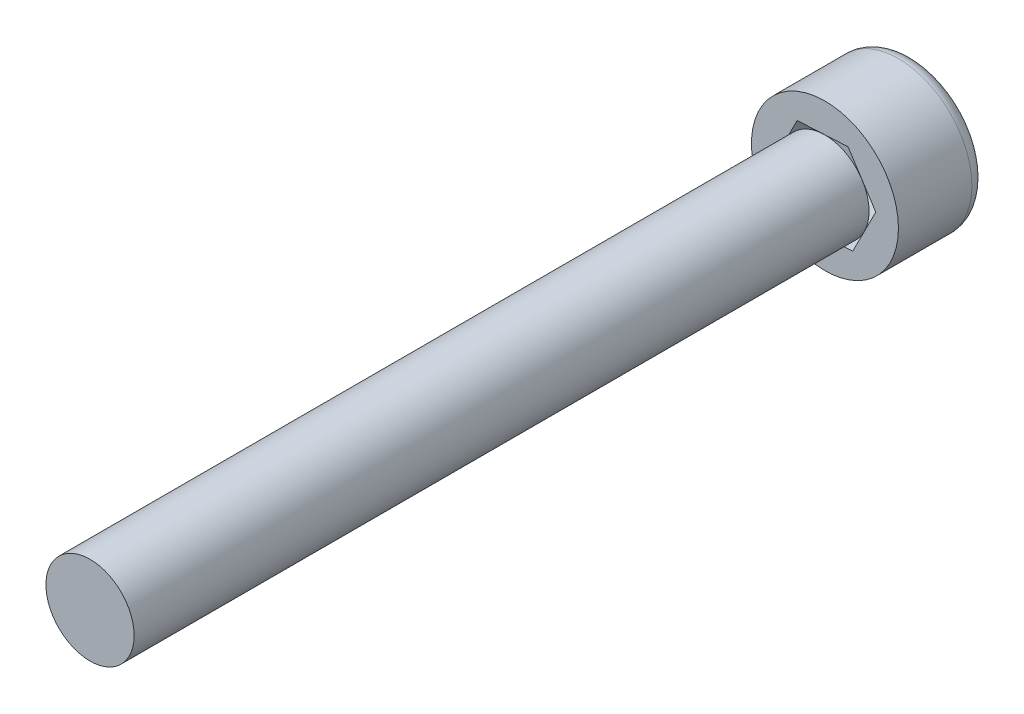
ISO-10303-21;
HEADER;
FILE_DESCRIPTION(('STEP AP214'),'2;1');
FILE_NAME('part.step','',(''),(''),'','','');
FILE_SCHEMA(('AUTOMOTIVE_DESIGN { 1 0 10303 214 1 1 1 1 }'));
ENDSEC;
DATA;
#1=APPLICATION_CONTEXT('core data for automotive mechanical design processes');
#2=APPLICATION_PROTOCOL_DEFINITION('international standard','automotive_design',2000,#1);
#3=PRODUCT_CONTEXT('',#1,'mechanical');
#4=PRODUCT('Part','Part','',(#3));
#5=PRODUCT_RELATED_PRODUCT_CATEGORY('part','',(#4));
#6=PRODUCT_DEFINITION_FORMATION('','',#4);
#7=PRODUCT_DEFINITION_CONTEXT('part definition',#1,'design');
#8=PRODUCT_DEFINITION('design','',#6,#7);
#9=PRODUCT_DEFINITION_SHAPE('','',#8);
#10=(LENGTH_UNIT() NAMED_UNIT(*) SI_UNIT(.MILLI.,.METRE.));
#11=(NAMED_UNIT(*) PLANE_ANGLE_UNIT() SI_UNIT($,.RADIAN.));
#12=(NAMED_UNIT(*) SI_UNIT($,.STERADIAN.) SOLID_ANGLE_UNIT());
#13=UNCERTAINTY_MEASURE_WITH_UNIT(LENGTH_MEASURE(1.E-05),#10,'distance_accuracy_value','');
#14=(GEOMETRIC_REPRESENTATION_CONTEXT(3) GLOBAL_UNCERTAINTY_ASSIGNED_CONTEXT((#13)) GLOBAL_UNIT_ASSIGNED_CONTEXT((#10,
#11,#12)) REPRESENTATION_CONTEXT('',''));
#15=CARTESIAN_POINT('',(0.,0.,0.));
#16=DIRECTION('',(0.,0.,1.));
#17=DIRECTION('',(1.,0.,0.));
#18=AXIS2_PLACEMENT_3D('',#15,#16,#17);
#19=CARTESIAN_POINT('',(0.,0.,3.));
#20=DIRECTION('',(0.,0.,-1.));
#21=DIRECTION('',(-1.,0.,0.));
#22=AXIS2_PLACEMENT_3D('',#19,#20,#21);
#23=CYLINDRICAL_SURFACE('',#22,2.5);
#24=CARTESIAN_POINT('',(0.,0.,0.5));
#25=DIRECTION('',(0.,0.,1.));
#26=DIRECTION('',(1.,0.,0.));
#27=AXIS2_PLACEMENT_3D('',#24,#25,#26);
#28=CIRCLE('',#27,2.5);
#29=CARTESIAN_POINT('',(2.5,0.,0.5));
#30=VERTEX_POINT('',#29);
#31=EDGE_CURVE('E49',#30,#30,#28,.T.);
#32=ORIENTED_EDGE('',*,*,#31,.T.);
#33=EDGE_LOOP('',(#32));
#34=FACE_BOUND('',#33,.T.);
#35=CARTESIAN_POINT('',(0.,0.,3.));
#36=DIRECTION('',(0.,0.,1.));
#37=DIRECTION('',(1.,0.,0.));
#38=AXIS2_PLACEMENT_3D('',#35,#36,#37);
#39=CIRCLE('',#38,2.5);
#40=CARTESIAN_POINT('',(2.5,0.,3.));
#41=VERTEX_POINT('',#40);
#42=EDGE_CURVE('E164',#41,#41,#39,.T.);
#43=ORIENTED_EDGE('',*,*,#42,.F.);
#44=EDGE_LOOP('',(#43));
#45=FACE_BOUND('',#44,.T.);
#46=ADVANCED_FACE('F40',(#34,#45),#23,.T.);
#47=CARTESIAN_POINT('',(0.,0.,3.));
#48=DIRECTION('',(0.,0.,1.));
#49=DIRECTION('',(1.,0.,0.));
#50=AXIS2_PLACEMENT_3D('',#47,#48,#49);
#51=PLANE('',#50);
#52=DIRECTION('',(-0.998565318577122,-0.0535472178079434,0.));
#53=VECTOR('',#52,1.);
#54=CARTESIAN_POINT('',(0.945103759937804,-1.45147472694203,3.));
#55=LINE('',#54,#53);
#56=CARTESIAN_POINT('',(0.945103759937804,-1.45147472694203,3.));
#57=VERTEX_POINT('',#56);
#58=CARTESIAN_POINT('',(-0.784462106513973,-1.54422122878934,3.));
#59=VERTEX_POINT('',#58);
#60=EDGE_CURVE('E93',#57,#59,#55,.T.);
#61=ORIENTED_EDGE('',*,*,#60,.T.);
#62=DIRECTION('',(-0.545655910212218,0.838009324321917,0.));
#63=VECTOR('',#62,1.);
#64=CARTESIAN_POINT('',(-0.784462106513973,-1.54422122878934,3.));
#65=LINE('',#64,#63);
#66=CARTESIAN_POINT('',(-1.72956586645178,-0.0927465018473138,3.));
#67=VERTEX_POINT('',#66);
#68=EDGE_CURVE('E56',#59,#67,#65,.T.);
#69=ORIENTED_EDGE('',*,*,#68,.T.);
#70=DIRECTION('',(0.452909408364904,0.89155654212986,0.));
#71=VECTOR('',#70,1.);
#72=CARTESIAN_POINT('',(-1.72956586645178,-0.0927465018473138,3.));
#73=LINE('',#72,#71);
#74=CARTESIAN_POINT('',(-0.945103759937803,1.45147472694203,3.));
#75=VERTEX_POINT('',#74);
#76=EDGE_CURVE('E103',#67,#75,#73,.T.);
#77=ORIENTED_EDGE('',*,*,#76,.T.);
#78=DIRECTION('',(0.998565318577122,0.0535472178079431,0.));
#79=VECTOR('',#78,1.);
#80=CARTESIAN_POINT('',(-0.945103759937803,1.45147472694203,3.));
#81=LINE('',#80,#79);
#82=CARTESIAN_POINT('',(0.784462106513974,1.54422122878934,3.));
#83=VERTEX_POINT('',#82);
#84=EDGE_CURVE('E175',#75,#83,#81,.T.);
#85=ORIENTED_EDGE('',*,*,#84,.T.);
#86=DIRECTION('',(0.545655910212218,-0.838009324321917,0.));
#87=VECTOR('',#86,1.);
#88=CARTESIAN_POINT('',(0.784462106513974,1.54422122878934,3.));
#89=LINE('',#88,#87);
#90=CARTESIAN_POINT('',(1.72956586645178,0.0927465018473145,3.));
#91=VERTEX_POINT('',#90);
#92=EDGE_CURVE('E173',#83,#91,#89,.T.);
#93=ORIENTED_EDGE('',*,*,#92,.T.);
#94=DIRECTION('',(-0.452909408364904,-0.89155654212986,0.));
#95=VECTOR('',#94,1.);
#96=CARTESIAN_POINT('',(1.72956586645178,0.0927465018473145,3.));
#97=LINE('',#96,#95);
#98=EDGE_CURVE('E108',#91,#57,#97,.T.);
#99=ORIENTED_EDGE('',*,*,#98,.T.);
#100=EDGE_LOOP('',(#61,#69,#77,#85,#93,#99));
#101=FACE_BOUND('',#100,.T.);
#102=ORIENTED_EDGE('',*,*,#42,.T.);
#103=EDGE_LOOP('',(#102));
#104=FACE_BOUND('',#103,.T.);
#105=ADVANCED_FACE('F105',(#101,#104),#51,.T.);
#106=CARTESIAN_POINT('',(0.,0.,0.));
#107=DIRECTION('',(0.,0.,1.));
#108=DIRECTION('',(1.,0.,0.));
#109=AXIS2_PLACEMENT_3D('',#106,#107,#108);
#110=PLANE('',#109);
#111=CARTESIAN_POINT('',(0.,0.,0.));
#112=DIRECTION('',(0.,0.,1.));
#113=DIRECTION('',(1.,0.,0.));
#114=AXIS2_PLACEMENT_3D('',#111,#112,#113);
#115=CIRCLE('',#114,2.);
#116=CARTESIAN_POINT('',(2.,0.,0.));
#117=VERTEX_POINT('',#116);
#118=EDGE_CURVE('E12',#117,#117,#115,.F.);
#119=ORIENTED_EDGE('',*,*,#118,.T.);
#120=EDGE_LOOP('',(#119));
#121=FACE_BOUND('',#120,.T.);
#122=DIRECTION('',(-0.545655910212218,0.838009324321917,0.));
#123=VECTOR('',#122,1.);
#124=CARTESIAN_POINT('',(-0.784462106513973,-1.54422122878934,0.));
#125=LINE('',#124,#123);
#126=CARTESIAN_POINT('',(-0.784462106513973,-1.54422122878934,0.));
#127=VERTEX_POINT('',#126);
#128=CARTESIAN_POINT('',(-1.72956586645178,-0.0927465018473138,0.));
#129=VERTEX_POINT('',#128);
#130=EDGE_CURVE('E98',#127,#129,#125,.T.);
#131=ORIENTED_EDGE('',*,*,#130,.F.);
#132=DIRECTION('',(-0.998565318577122,-0.0535472178079434,0.));
#133=VECTOR('',#132,1.);
#134=CARTESIAN_POINT('',(0.945103759937804,-1.45147472694203,0.));
#135=LINE('',#134,#133);
#136=CARTESIAN_POINT('',(0.945103759937804,-1.45147472694203,0.));
#137=VERTEX_POINT('',#136);
#138=EDGE_CURVE('E89',#137,#127,#135,.T.);
#139=ORIENTED_EDGE('',*,*,#138,.F.);
#140=DIRECTION('',(-0.452909408364904,-0.89155654212986,0.));
#141=VECTOR('',#140,1.);
#142=CARTESIAN_POINT('',(1.72956586645178,0.0927465018473145,0.));
#143=LINE('',#142,#141);
#144=CARTESIAN_POINT('',(1.72956586645178,0.0927465018473145,0.));
#145=VERTEX_POINT('',#144);
#146=EDGE_CURVE('E155',#145,#137,#143,.T.);
#147=ORIENTED_EDGE('',*,*,#146,.F.);
#148=DIRECTION('',(0.545655910212218,-0.838009324321917,0.));
#149=VECTOR('',#148,1.);
#150=CARTESIAN_POINT('',(0.784462106513974,1.54422122878934,0.));
#151=LINE('',#150,#149);
#152=CARTESIAN_POINT('',(0.784462106513974,1.54422122878934,0.));
#153=VERTEX_POINT('',#152);
#154=EDGE_CURVE('E188',#153,#145,#151,.T.);
#155=ORIENTED_EDGE('',*,*,#154,.F.);
#156=DIRECTION('',(0.998565318577122,0.0535472178079431,0.));
#157=VECTOR('',#156,1.);
#158=CARTESIAN_POINT('',(-0.945103759937803,1.45147472694203,0.));
#159=LINE('',#158,#157);
#160=CARTESIAN_POINT('',(-0.945103759937803,1.45147472694203,0.));
#161=VERTEX_POINT('',#160);
#162=EDGE_CURVE('E184',#161,#153,#159,.T.);
#163=ORIENTED_EDGE('',*,*,#162,.F.);
#164=DIRECTION('',(0.452909408364904,0.89155654212986,0.));
#165=VECTOR('',#164,1.);
#166=CARTESIAN_POINT('',(-1.72956586645178,-0.0927465018473138,0.));
#167=LINE('',#166,#165);
#168=EDGE_CURVE('E181',#129,#161,#167,.T.);
#169=ORIENTED_EDGE('',*,*,#168,.F.);
#170=EDGE_LOOP('',(#131,#139,#147,#155,#163,#169));
#171=FACE_BOUND('',#170,.T.);
#172=ADVANCED_FACE('F130',(#121,#171),#110,.F.);
#173=CARTESIAN_POINT('',(0.945103759937804,-1.45147472694203,3.));
#174=DIRECTION('',(0.0535472178079434,-0.998565318577122,0.));
#175=DIRECTION('',(0.998565318577122,0.0535472178079434,0.));
#176=AXIS2_PLACEMENT_3D('',#173,#174,#175);
#177=PLANE('',#176);
#178=ORIENTED_EDGE('',*,*,#138,.T.);
#179=DIRECTION('',(0.,0.,-1.));
#180=VECTOR('',#179,1.);
#181=CARTESIAN_POINT('',(-0.784462106513973,-1.54422122878934,3.));
#182=LINE('',#181,#180);
#183=EDGE_CURVE('E91',#59,#127,#182,.T.);
#184=ORIENTED_EDGE('',*,*,#183,.F.);
#185=ORIENTED_EDGE('',*,*,#60,.F.);
#186=DIRECTION('',(0.,0.,-1.));
#187=VECTOR('',#186,1.);
#188=CARTESIAN_POINT('',(0.945103759937804,-1.45147472694203,3.));
#189=LINE('',#188,#187);
#190=EDGE_CURVE('E156',#57,#137,#189,.T.);
#191=ORIENTED_EDGE('',*,*,#190,.T.);
#192=EDGE_LOOP('',(#178,#184,#185,#191));
#193=FACE_BOUND('',#192,.T.);
#194=ADVANCED_FACE('F92',(#193),#177,.F.);
#195=CARTESIAN_POINT('',(1.72956586645178,0.0927465018473145,3.));
#196=DIRECTION('',(0.89155654212986,-0.452909408364904,0.));
#197=DIRECTION('',(0.452909408364904,0.89155654212986,0.));
#198=AXIS2_PLACEMENT_3D('',#195,#196,#197);
#199=PLANE('',#198);
#200=ORIENTED_EDGE('',*,*,#146,.T.);
#201=ORIENTED_EDGE('',*,*,#190,.F.);
#202=ORIENTED_EDGE('',*,*,#98,.F.);
#203=DIRECTION('',(0.,0.,-1.));
#204=VECTOR('',#203,1.);
#205=CARTESIAN_POINT('',(1.72956586645178,0.0927465018473145,3.));
#206=LINE('',#205,#204);
#207=EDGE_CURVE('E158',#91,#145,#206,.T.);
#208=ORIENTED_EDGE('',*,*,#207,.T.);
#209=EDGE_LOOP('',(#200,#201,#202,#208));
#210=FACE_BOUND('',#209,.T.);
#211=ADVANCED_FACE('F137',(#210),#199,.F.);
#212=CARTESIAN_POINT('',(0.784462106513974,1.54422122878934,3.));
#213=DIRECTION('',(0.838009324321917,0.545655910212218,0.));
#214=DIRECTION('',(-0.545655910212218,0.838009324321917,0.));
#215=AXIS2_PLACEMENT_3D('',#212,#213,#214);
#216=PLANE('',#215);
#217=ORIENTED_EDGE('',*,*,#154,.T.);
#218=ORIENTED_EDGE('',*,*,#207,.F.);
#219=ORIENTED_EDGE('',*,*,#92,.F.);
#220=DIRECTION('',(0.,0.,-1.));
#221=VECTOR('',#220,1.);
#222=CARTESIAN_POINT('',(0.784462106513974,1.54422122878934,3.));
#223=LINE('',#222,#221);
#224=EDGE_CURVE('E186',#83,#153,#223,.T.);
#225=ORIENTED_EDGE('',*,*,#224,.T.);
#226=EDGE_LOOP('',(#217,#218,#219,#225));
#227=FACE_BOUND('',#226,.T.);
#228=ADVANCED_FACE('F145',(#227),#216,.F.);
#229=CARTESIAN_POINT('',(-0.945103759937803,1.45147472694203,3.));
#230=DIRECTION('',(-0.0535472178079431,0.998565318577122,0.));
#231=DIRECTION('',(-0.998565318577122,-0.0535472178079432,0.));
#232=AXIS2_PLACEMENT_3D('',#229,#230,#231);
#233=PLANE('',#232);
#234=ORIENTED_EDGE('',*,*,#162,.T.);
#235=ORIENTED_EDGE('',*,*,#224,.F.);
#236=ORIENTED_EDGE('',*,*,#84,.F.);
#237=DIRECTION('',(0.,0.,-1.));
#238=VECTOR('',#237,1.);
#239=CARTESIAN_POINT('',(-0.945103759937803,1.45147472694203,3.));
#240=LINE('',#239,#238);
#241=EDGE_CURVE('E180',#75,#161,#240,.T.);
#242=ORIENTED_EDGE('',*,*,#241,.T.);
#243=EDGE_LOOP('',(#234,#235,#236,#242));
#244=FACE_BOUND('',#243,.T.);
#245=ADVANCED_FACE('F141',(#244),#233,.F.);
#246=CARTESIAN_POINT('',(-1.72956586645178,-0.0927465018473138,3.));
#247=DIRECTION('',(-0.89155654212986,0.452909408364904,0.));
#248=DIRECTION('',(-0.452909408364904,-0.89155654212986,0.));
#249=AXIS2_PLACEMENT_3D('',#246,#247,#248);
#250=PLANE('',#249);
#251=ORIENTED_EDGE('',*,*,#168,.T.);
#252=ORIENTED_EDGE('',*,*,#241,.F.);
#253=ORIENTED_EDGE('',*,*,#76,.F.);
#254=DIRECTION('',(0.,0.,-1.));
#255=VECTOR('',#254,1.);
#256=CARTESIAN_POINT('',(-1.72956586645178,-0.0927465018473138,3.));
#257=LINE('',#256,#255);
#258=EDGE_CURVE('E101',#67,#129,#257,.T.);
#259=ORIENTED_EDGE('',*,*,#258,.T.);
#260=EDGE_LOOP('',(#251,#252,#253,#259));
#261=FACE_BOUND('',#260,.T.);
#262=ADVANCED_FACE('F122',(#261),#250,.F.);
#263=CARTESIAN_POINT('',(-0.784462106513973,-1.54422122878934,3.));
#264=DIRECTION('',(-0.838009324321917,-0.545655910212218,0.));
#265=DIRECTION('',(0.545655910212218,-0.838009324321917,0.));
#266=AXIS2_PLACEMENT_3D('',#263,#264,#265);
#267=PLANE('',#266);
#268=ORIENTED_EDGE('',*,*,#130,.T.);
#269=ORIENTED_EDGE('',*,*,#258,.F.);
#270=ORIENTED_EDGE('',*,*,#68,.F.);
#271=ORIENTED_EDGE('',*,*,#183,.T.);
#272=EDGE_LOOP('',(#268,#269,#270,#271));
#273=FACE_BOUND('',#272,.T.);
#274=ADVANCED_FACE('F100',(#273),#267,.F.);
#275=CARTESIAN_POINT('',(0.,0.,0.5));
#276=DIRECTION('',(0.,0.,1.));
#277=DIRECTION('',(1.,0.,0.));
#278=AXIS2_PLACEMENT_3D('',#275,#276,#277);
#279=TOROIDAL_SURFACE('',#278,2.,0.5);
#280=ORIENTED_EDGE('',*,*,#118,.F.);
#281=EDGE_LOOP('',(#280));
#282=FACE_BOUND('',#281,.T.);
#283=ORIENTED_EDGE('',*,*,#31,.F.);
#284=EDGE_LOOP('',(#283));
#285=FACE_BOUND('',#284,.T.);
#286=ADVANCED_FACE('F42',(#282,#285),#279,.T.);
#287=CLOSED_SHELL('',(#46,#105,#172,#194,#211,#228,#245,#262,#274,#286));
#288=MANIFOLD_SOLID_BREP('B2',#287);
#289=CARTESIAN_POINT('',(0.,0.,28.));
#290=DIRECTION('',(0.,0.,1.));
#291=DIRECTION('',(1.,0.,0.));
#292=AXIS2_PLACEMENT_3D('',#289,#290,#291);
#293=PLANE('',#292);
#294=CARTESIAN_POINT('',(0.,0.,28.));
#295=DIRECTION('',(0.,0.,1.));
#296=DIRECTION('',(1.,0.,0.));
#297=AXIS2_PLACEMENT_3D('',#294,#295,#296);
#298=CIRCLE('',#297,1.5);
#299=CARTESIAN_POINT('',(1.5,0.,28.));
#300=VERTEX_POINT('',#299);
#301=EDGE_CURVE('E258',#300,#300,#298,.T.);
#302=ORIENTED_EDGE('',*,*,#301,.T.);
#303=EDGE_LOOP('',(#302));
#304=FACE_BOUND('',#303,.T.);
#305=ADVANCED_FACE('F251',(#304),#293,.T.);
#306=CARTESIAN_POINT('',(0.,0.,28.));
#307=DIRECTION('',(0.,0.,-1.));
#308=DIRECTION('',(-1.,0.,0.));
#309=AXIS2_PLACEMENT_3D('',#306,#307,#308);
#310=CYLINDRICAL_SURFACE('',#309,1.5);
#311=ORIENTED_EDGE('',*,*,#301,.F.);
#312=EDGE_LOOP('',(#311));
#313=FACE_BOUND('',#312,.T.);
#314=CARTESIAN_POINT('',(0.,0.,3.));
#315=DIRECTION('',(0.,0.,1.));
#316=DIRECTION('',(1.,0.,0.));
#317=AXIS2_PLACEMENT_3D('',#314,#315,#316);
#318=CIRCLE('',#317,1.5);
#319=CARTESIAN_POINT('',(1.5,0.,3.));
#320=VERTEX_POINT('',#319);
#321=EDGE_CURVE('E39',#320,#320,#318,.T.);
#322=ORIENTED_EDGE('',*,*,#321,.T.);
#323=EDGE_LOOP('',(#322));
#324=FACE_BOUND('',#323,.T.);
#325=ADVANCED_FACE('F253',(#313,#324),#310,.T.);
#326=CARTESIAN_POINT('',(0.,0.,3.));
#327=DIRECTION('',(0.,0.,-1.));
#328=DIRECTION('',(-1.,0.,0.));
#329=AXIS2_PLACEMENT_3D('',#326,#327,#328);
#330=PLANE('',#329);
#331=ORIENTED_EDGE('',*,*,#321,.F.);
#332=EDGE_LOOP('',(#331));
#333=FACE_BOUND('',#332,.T.);
#334=ADVANCED_FACE('F266',(#333),#330,.T.);
#335=CLOSED_SHELL('',(#305,#325,#334));
#336=MANIFOLD_SOLID_BREP('B6',#335);
#337=ADVANCED_BREP_SHAPE_REPRESENTATION('',(#18,#288,#336),#14);
#338=SHAPE_DEFINITION_REPRESENTATION(#9,#337);
ENDSEC;
END-ISO-10303-21;
